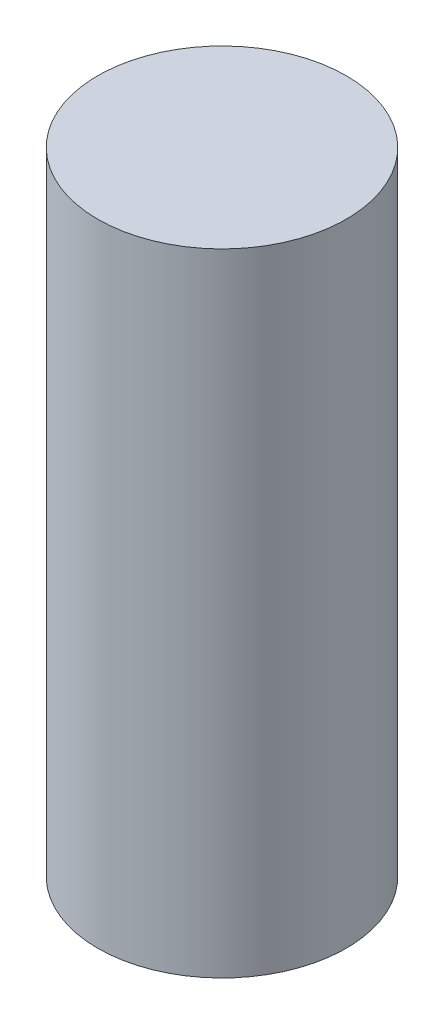
ISO-10303-21;
HEADER;
FILE_DESCRIPTION(('STEP AP214'),'2;1');
FILE_NAME('part.step','',(''),(''),'','','');
FILE_SCHEMA(('AUTOMOTIVE_DESIGN { 1 0 10303 214 1 1 1 1 }'));
ENDSEC;
DATA;
#1=APPLICATION_CONTEXT('core data for automotive mechanical design processes');
#2=APPLICATION_PROTOCOL_DEFINITION('international standard','automotive_design',2000,#1);
#3=PRODUCT_CONTEXT('',#1,'mechanical');
#4=PRODUCT('Part','Part','',(#3));
#5=PRODUCT_RELATED_PRODUCT_CATEGORY('part','',(#4));
#6=PRODUCT_DEFINITION_FORMATION('','',#4);
#7=PRODUCT_DEFINITION_CONTEXT('part definition',#1,'design');
#8=PRODUCT_DEFINITION('design','',#6,#7);
#9=PRODUCT_DEFINITION_SHAPE('','',#8);
#10=(LENGTH_UNIT() NAMED_UNIT(*) SI_UNIT(.MILLI.,.METRE.));
#11=(NAMED_UNIT(*) PLANE_ANGLE_UNIT() SI_UNIT($,.RADIAN.));
#12=(NAMED_UNIT(*) SI_UNIT($,.STERADIAN.) SOLID_ANGLE_UNIT());
#13=UNCERTAINTY_MEASURE_WITH_UNIT(LENGTH_MEASURE(1.E-05),#10,'distance_accuracy_value','');
#14=(GEOMETRIC_REPRESENTATION_CONTEXT(3) GLOBAL_UNCERTAINTY_ASSIGNED_CONTEXT((#13)) GLOBAL_UNIT_ASSIGNED_CONTEXT((#10,
#11,#12)) REPRESENTATION_CONTEXT('',''));
#15=CARTESIAN_POINT('',(0.,0.,0.));
#16=DIRECTION('',(0.,0.,1.));
#17=DIRECTION('',(1.,0.,0.));
#18=AXIS2_PLACEMENT_3D('',#15,#16,#17);
#19=CARTESIAN_POINT('',(0.,7.62,0.));
#20=DIRECTION('',(0.,-1.,0.));
#21=DIRECTION('',(0.,0.,-1.));
#22=AXIS2_PLACEMENT_3D('',#19,#20,#21);
#23=CYLINDRICAL_SURFACE('',#22,1.5);
#24=CARTESIAN_POINT('',(0.,7.62,0.));
#25=DIRECTION('',(0.,1.,0.));
#26=DIRECTION('',(0.,0.,1.));
#27=AXIS2_PLACEMENT_3D('',#24,#25,#26);
#28=CIRCLE('',#27,1.5);
#29=CARTESIAN_POINT('',(0.,7.62,1.5));
#30=VERTEX_POINT('',#29);
#31=EDGE_CURVE('E10',#30,#30,#28,.T.);
#32=ORIENTED_EDGE('',*,*,#31,.F.);
#33=EDGE_LOOP('',(#32));
#34=FACE_BOUND('',#33,.T.);
#35=CARTESIAN_POINT('',(0.,0.,0.));
#36=DIRECTION('',(0.,1.,0.));
#37=DIRECTION('',(0.,0.,1.));
#38=AXIS2_PLACEMENT_3D('',#35,#36,#37);
#39=CIRCLE('',#38,1.5);
#40=CARTESIAN_POINT('',(0.,0.,1.5));
#41=VERTEX_POINT('',#40);
#42=EDGE_CURVE('E32',#41,#41,#39,.T.);
#43=ORIENTED_EDGE('',*,*,#42,.T.);
#44=EDGE_LOOP('',(#43));
#45=FACE_BOUND('',#44,.T.);
#46=ADVANCED_FACE('F29',(#34,#45),#23,.T.);
#47=CARTESIAN_POINT('',(0.,7.62,0.));
#48=DIRECTION('',(0.,1.,0.));
#49=DIRECTION('',(0.,0.,1.));
#50=AXIS2_PLACEMENT_3D('',#47,#48,#49);
#51=PLANE('',#50);
#52=ORIENTED_EDGE('',*,*,#31,.T.);
#53=EDGE_LOOP('',(#52));
#54=FACE_BOUND('',#53,.T.);
#55=ADVANCED_FACE('F44',(#54),#51,.T.);
#56=CARTESIAN_POINT('',(0.,0.,0.));
#57=DIRECTION('',(0.,1.,0.));
#58=DIRECTION('',(0.,0.,1.));
#59=AXIS2_PLACEMENT_3D('',#56,#57,#58);
#60=PLANE('',#59);
#61=ORIENTED_EDGE('',*,*,#42,.F.);
#62=EDGE_LOOP('',(#61));
#63=FACE_BOUND('',#62,.T.);
#64=ADVANCED_FACE('F42',(#63),#60,.F.);
#65=CLOSED_SHELL('',(#46,#55,#64));
#66=MANIFOLD_SOLID_BREP('B2',#65);
#67=ADVANCED_BREP_SHAPE_REPRESENTATION('',(#18,#66),#14);
#68=SHAPE_DEFINITION_REPRESENTATION(#9,#67);
ENDSEC;
END-ISO-10303-21;
